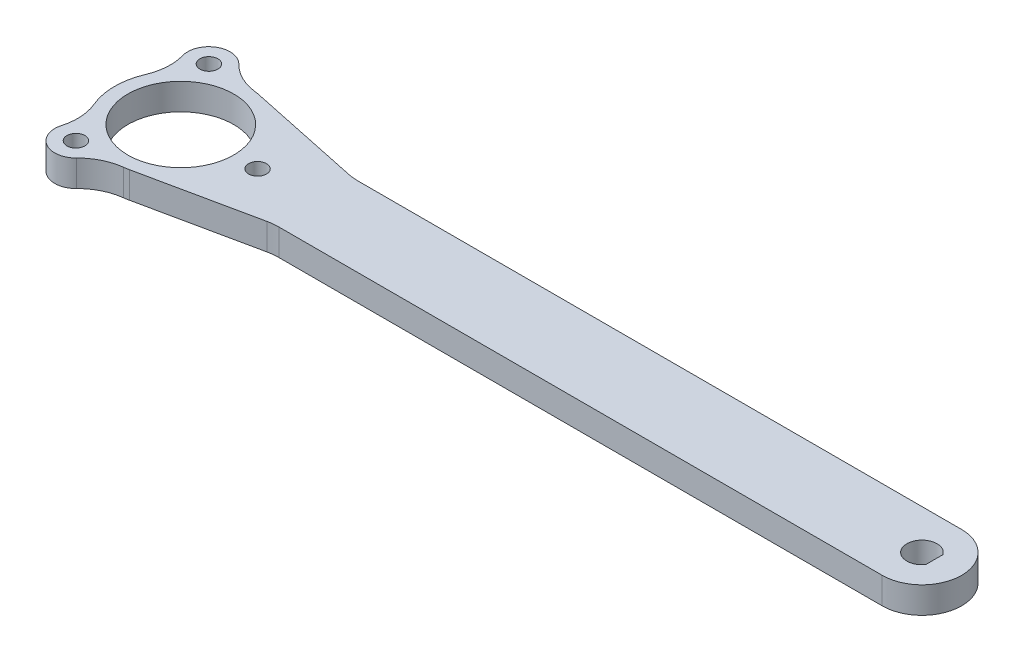
ISO-10303-21;
HEADER;
FILE_DESCRIPTION(('STEP AP214'),'2;1');
FILE_NAME('part.step','',(''),(''),'','','');
FILE_SCHEMA(('AUTOMOTIVE_DESIGN { 1 0 10303 214 1 1 1 1 }'));
ENDSEC;
DATA;
#1=APPLICATION_CONTEXT('core data for automotive mechanical design processes');
#2=APPLICATION_PROTOCOL_DEFINITION('international standard','automotive_design',2000,#1);
#3=PRODUCT_CONTEXT('',#1,'mechanical');
#4=PRODUCT('Part','Part','',(#3));
#5=PRODUCT_RELATED_PRODUCT_CATEGORY('part','',(#4));
#6=PRODUCT_DEFINITION_FORMATION('','',#4);
#7=PRODUCT_DEFINITION_CONTEXT('part definition',#1,'design');
#8=PRODUCT_DEFINITION('design','',#6,#7);
#9=PRODUCT_DEFINITION_SHAPE('','',#8);
#10=(LENGTH_UNIT() NAMED_UNIT(*) SI_UNIT(.MILLI.,.METRE.));
#11=(NAMED_UNIT(*) PLANE_ANGLE_UNIT() SI_UNIT($,.RADIAN.));
#12=(NAMED_UNIT(*) SI_UNIT($,.STERADIAN.) SOLID_ANGLE_UNIT());
#13=UNCERTAINTY_MEASURE_WITH_UNIT(LENGTH_MEASURE(1.E-05),#10,'distance_accuracy_value','');
#14=(GEOMETRIC_REPRESENTATION_CONTEXT(3) GLOBAL_UNCERTAINTY_ASSIGNED_CONTEXT((#13)) GLOBAL_UNIT_ASSIGNED_CONTEXT((#10,
#11,#12)) REPRESENTATION_CONTEXT('',''));
#15=CARTESIAN_POINT('',(0.,0.,0.));
#16=DIRECTION('',(0.,0.,1.));
#17=DIRECTION('',(1.,0.,0.));
#18=AXIS2_PLACEMENT_3D('',#15,#16,#17);
#19=CARTESIAN_POINT('',(0.,5.,0.));
#20=DIRECTION('',(0.,-1.,0.));
#21=DIRECTION('',(0.,0.,-1.));
#22=AXIS2_PLACEMENT_3D('',#19,#20,#21);
#23=CYLINDRICAL_SURFACE('',#22,12.5);
#24=CARTESIAN_POINT('',(0.,0.,0.));
#25=DIRECTION('',(0.,1.,0.));
#26=DIRECTION('',(0.,0.,1.));
#27=AXIS2_PLACEMENT_3D('',#24,#25,#26);
#28=CIRCLE('',#27,12.5);
#29=CARTESIAN_POINT('',(-11.5138720064284,0.,-4.86628723151269));
#30=VERTEX_POINT('',#29);
#31=CARTESIAN_POINT('',(-11.5138720064284,0.,4.86628723151285));
#32=VERTEX_POINT('',#31);
#33=EDGE_CURVE('E308',#30,#32,#28,.T.);
#34=ORIENTED_EDGE('',*,*,#33,.T.);
#35=DIRECTION('',(0.,-1.,0.));
#36=VECTOR('',#35,1.);
#37=CARTESIAN_POINT('',(-11.5138720064284,5.,4.86628723151285));
#38=LINE('',#37,#36);
#39=CARTESIAN_POINT('',(-11.5138720064284,5.,4.86628723151285));
#40=VERTEX_POINT('',#39);
#41=EDGE_CURVE('E219',#32,#40,#38,.F.);
#42=ORIENTED_EDGE('',*,*,#41,.T.);
#43=CARTESIAN_POINT('',(0.,5.,0.));
#44=DIRECTION('',(0.,1.,0.));
#45=DIRECTION('',(0.,0.,1.));
#46=AXIS2_PLACEMENT_3D('',#43,#44,#45);
#47=CIRCLE('',#46,12.5);
#48=CARTESIAN_POINT('',(-11.5138720064284,5.,-4.86628723151269));
#49=VERTEX_POINT('',#48);
#50=EDGE_CURVE('E368',#49,#40,#47,.T.);
#51=ORIENTED_EDGE('',*,*,#50,.F.);
#52=DIRECTION('',(0.,-1.,0.));
#53=VECTOR('',#52,1.);
#54=CARTESIAN_POINT('',(-11.5138720064284,5.,-4.86628723151269));
#55=LINE('',#54,#53);
#56=EDGE_CURVE('E216',#49,#30,#55,.T.);
#57=ORIENTED_EDGE('',*,*,#56,.T.);
#58=EDGE_LOOP('',(#34,#42,#51,#57));
#59=FACE_BOUND('',#58,.T.);
#60=ADVANCED_FACE('F41',(#59),#23,.T.);
#61=CARTESIAN_POINT('',(2.580796540168,0.,-12.23067819944));
#62=VERTEX_POINT('',#61);
#63=CARTESIAN_POINT('',(1.54260763861227,0.,-12.4044492692459));
#64=VERTEX_POINT('',#63);
#65=EDGE_CURVE('E293',#62,#64,#28,.T.);
#66=ORIENTED_EDGE('',*,*,#65,.T.);
#67=DIRECTION('',(0.,-1.,0.));
#68=VECTOR('',#67,1.);
#69=CARTESIAN_POINT('',(1.54260763861227,5.,-12.4044492692459));
#70=LINE('',#69,#68);
#71=CARTESIAN_POINT('',(1.54260763861227,5.,-12.4044492692459));
#72=VERTEX_POINT('',#71);
#73=EDGE_CURVE('E230',#64,#72,#70,.F.);
#74=ORIENTED_EDGE('',*,*,#73,.T.);
#75=CARTESIAN_POINT('',(2.580796540168,5.,-12.23067819944));
#76=VERTEX_POINT('',#75);
#77=EDGE_CURVE('E296',#76,#72,#47,.T.);
#78=ORIENTED_EDGE('',*,*,#77,.F.);
#79=DIRECTION('',(0.,-1.,0.));
#80=VECTOR('',#79,1.);
#81=CARTESIAN_POINT('',(2.580796540168,5.,-12.23067819944));
#82=LINE('',#81,#80);
#83=EDGE_CURVE('E202',#76,#62,#82,.T.);
#84=ORIENTED_EDGE('',*,*,#83,.T.);
#85=EDGE_LOOP('',(#66,#74,#78,#84));
#86=FACE_BOUND('',#85,.T.);
#87=ADVANCED_FACE('F292',(#86),#23,.T.);
#88=CARTESIAN_POINT('',(140.,5.,0.));
#89=DIRECTION('',(0.,-1.,0.));
#90=DIRECTION('',(0.,0.,-1.));
#91=AXIS2_PLACEMENT_3D('',#88,#89,#90);
#92=CYLINDRICAL_SURFACE('',#91,2.85);
#93=CARTESIAN_POINT('',(140.,0.,0.));
#94=DIRECTION('',(0.,1.,0.));
#95=DIRECTION('',(0.,0.,1.));
#96=AXIS2_PLACEMENT_3D('',#93,#94,#95);
#97=CIRCLE('',#96,2.85);
#98=CARTESIAN_POINT('',(142.348879749008,0.,-1.61408299808355));
#99=VERTEX_POINT('',#98);
#100=CARTESIAN_POINT('',(142.348879749008,0.,1.61408299808355));
#101=VERTEX_POINT('',#100);
#102=EDGE_CURVE('E329',#99,#101,#97,.T.);
#103=ORIENTED_EDGE('',*,*,#102,.F.);
#104=DIRECTION('',(0.,-1.,0.));
#105=VECTOR('',#104,1.);
#106=CARTESIAN_POINT('',(142.348879749008,5.,-1.61408299808355));
#107=LINE('',#106,#105);
#108=CARTESIAN_POINT('',(142.348879749008,5.,-1.61408299808355));
#109=VERTEX_POINT('',#108);
#110=EDGE_CURVE('E200',#109,#99,#107,.T.);
#111=ORIENTED_EDGE('',*,*,#110,.F.);
#112=CARTESIAN_POINT('',(140.,5.,0.));
#113=DIRECTION('',(0.,1.,0.));
#114=DIRECTION('',(0.,0.,1.));
#115=AXIS2_PLACEMENT_3D('',#112,#113,#114);
#116=CIRCLE('',#115,2.85);
#117=CARTESIAN_POINT('',(142.348879749008,5.,1.61408299808355));
#118=VERTEX_POINT('',#117);
#119=EDGE_CURVE('E342',#109,#118,#116,.T.);
#120=ORIENTED_EDGE('',*,*,#119,.T.);
#121=DIRECTION('',(0.,-1.,0.));
#122=VECTOR('',#121,1.);
#123=CARTESIAN_POINT('',(142.348879749008,5.,1.61408299808355));
#124=LINE('',#123,#122);
#125=EDGE_CURVE('E196',#118,#101,#124,.T.);
#126=ORIENTED_EDGE('',*,*,#125,.T.);
#127=EDGE_LOOP('',(#103,#111,#120,#126));
#128=FACE_BOUND('',#127,.T.);
#129=ADVANCED_FACE('F340',(#128),#92,.F.);
#130=CARTESIAN_POINT('',(0.,5.,7.5));
#131=DIRECTION('',(0.,0.,-1.));
#132=DIRECTION('',(-1.,0.,0.));
#133=AXIS2_PLACEMENT_3D('',#130,#131,#132);
#134=PLANE('',#133);
#135=DIRECTION('',(1.,0.,0.));
#136=VECTOR('',#135,1.);
#137=CARTESIAN_POINT('',(0.,5.,7.5));
#138=LINE('',#137,#136);
#139=CARTESIAN_POINT('',(26.0435607626104,5.,7.5));
#140=VERTEX_POINT('',#139);
#141=CARTESIAN_POINT('',(140.,5.,7.50000000000001));
#142=VERTEX_POINT('',#141);
#143=EDGE_CURVE('E165',#140,#142,#138,.T.);
#144=ORIENTED_EDGE('',*,*,#143,.F.);
#145=DIRECTION('',(0.,-1.,0.));
#146=VECTOR('',#145,1.);
#147=CARTESIAN_POINT('',(26.0435607626104,0.,7.5));
#148=LINE('',#147,#146);
#149=CARTESIAN_POINT('',(26.0435607626104,0.,7.5));
#150=VERTEX_POINT('',#149);
#151=EDGE_CURVE('E234',#140,#150,#148,.T.);
#152=ORIENTED_EDGE('',*,*,#151,.T.);
#153=DIRECTION('',(1.,0.,0.));
#154=VECTOR('',#153,1.);
#155=CARTESIAN_POINT('',(0.,0.,7.5));
#156=LINE('',#155,#154);
#157=CARTESIAN_POINT('',(140.,0.,7.50000000000001));
#158=VERTEX_POINT('',#157);
#159=EDGE_CURVE('E193',#150,#158,#156,.T.);
#160=ORIENTED_EDGE('',*,*,#159,.T.);
#161=DIRECTION('',(0.,-1.,0.));
#162=VECTOR('',#161,1.);
#163=CARTESIAN_POINT('',(140.,5.,7.50000000000001));
#164=LINE('',#163,#162);
#165=EDGE_CURVE('E185',#142,#158,#164,.T.);
#166=ORIENTED_EDGE('',*,*,#165,.F.);
#167=EDGE_LOOP('',(#144,#152,#160,#166));
#168=FACE_BOUND('',#167,.T.);
#169=ADVANCED_FACE('F191',(#168),#134,.F.);
#170=CARTESIAN_POINT('',(140.,5.,0.));
#171=DIRECTION('',(0.,-1.,0.));
#172=DIRECTION('',(0.,0.,-1.));
#173=AXIS2_PLACEMENT_3D('',#170,#171,#172);
#174=CYLINDRICAL_SURFACE('',#173,7.50000000000001);
#175=CARTESIAN_POINT('',(140.,0.,0.));
#176=DIRECTION('',(0.,1.,0.));
#177=DIRECTION('',(0.,0.,1.));
#178=AXIS2_PLACEMENT_3D('',#175,#176,#177);
#179=CIRCLE('',#178,7.50000000000001);
#180=CARTESIAN_POINT('',(140.,0.,-7.50000000000001));
#181=VERTEX_POINT('',#180);
#182=EDGE_CURVE('E318',#158,#181,#179,.T.);
#183=ORIENTED_EDGE('',*,*,#182,.T.);
#184=DIRECTION('',(0.,-1.,0.));
#185=VECTOR('',#184,1.);
#186=CARTESIAN_POINT('',(140.,5.,-7.50000000000001));
#187=LINE('',#186,#185);
#188=CARTESIAN_POINT('',(140.,5.,-7.50000000000001));
#189=VERTEX_POINT('',#188);
#190=EDGE_CURVE('E187',#189,#181,#187,.T.);
#191=ORIENTED_EDGE('',*,*,#190,.F.);
#192=CARTESIAN_POINT('',(140.,5.,0.));
#193=DIRECTION('',(0.,1.,0.));
#194=DIRECTION('',(0.,0.,1.));
#195=AXIS2_PLACEMENT_3D('',#192,#193,#194);
#196=CIRCLE('',#195,7.50000000000001);
#197=EDGE_CURVE('E170',#142,#189,#196,.T.);
#198=ORIENTED_EDGE('',*,*,#197,.F.);
#199=ORIENTED_EDGE('',*,*,#165,.T.);
#200=EDGE_LOOP('',(#183,#191,#198,#199));
#201=FACE_BOUND('',#200,.T.);
#202=ADVANCED_FACE('F184',(#201),#174,.T.);
#203=CARTESIAN_POINT('',(0.,5.,-7.5));
#204=DIRECTION('',(0.,0.,-1.));
#205=DIRECTION('',(-1.,0.,0.));
#206=AXIS2_PLACEMENT_3D('',#203,#204,#205);
#207=PLANE('',#206);
#208=DIRECTION('',(1.,0.,0.));
#209=VECTOR('',#208,1.);
#210=CARTESIAN_POINT('',(0.,0.,-7.5));
#211=LINE('',#210,#209);
#212=CARTESIAN_POINT('',(26.0435607626104,0.,-7.5));
#213=VERTEX_POINT('',#212);
#214=EDGE_CURVE('E314',#213,#181,#211,.T.);
#215=ORIENTED_EDGE('',*,*,#214,.F.);
#216=DIRECTION('',(0.,-1.,0.));
#217=VECTOR('',#216,1.);
#218=CARTESIAN_POINT('',(26.0435607626104,5.,-7.5));
#219=LINE('',#218,#217);
#220=CARTESIAN_POINT('',(26.0435607626104,5.,-7.5));
#221=VERTEX_POINT('',#220);
#222=EDGE_CURVE('E57',#213,#221,#219,.F.);
#223=ORIENTED_EDGE('',*,*,#222,.T.);
#224=DIRECTION('',(1.,0.,0.));
#225=VECTOR('',#224,1.);
#226=CARTESIAN_POINT('',(0.,5.,-7.5));
#227=LINE('',#226,#225);
#228=EDGE_CURVE('E189',#221,#189,#227,.T.);
#229=ORIENTED_EDGE('',*,*,#228,.T.);
#230=ORIENTED_EDGE('',*,*,#190,.T.);
#231=EDGE_LOOP('',(#215,#223,#229,#230));
#232=FACE_BOUND('',#231,.T.);
#233=ADVANCED_FACE('F358',(#232),#207,.T.);
#234=CARTESIAN_POINT('',(2.580796540168,5.,-12.23067819944));
#235=DIRECTION('',(0.20646372321344,0.,-0.9784542559552));
#236=DIRECTION('',(-0.9784542559552,0.,-0.20646372321344));
#237=AXIS2_PLACEMENT_3D('',#234,#235,#236);
#238=PLANE('',#237);
#239=DIRECTION('',(0.9784542559552,0.,0.20646372321344));
#240=VECTOR('',#239,1.);
#241=CARTESIAN_POINT('',(2.580796540168,5.,-12.23067819944));
#242=LINE('',#241,#240);
#243=CARTESIAN_POINT('',(23.978923530476,5.,-7.715457440448));
#244=VERTEX_POINT('',#243);
#245=EDGE_CURVE('E361',#76,#244,#242,.T.);
#246=ORIENTED_EDGE('',*,*,#245,.T.);
#247=DIRECTION('',(0.,-1.,0.));
#248=VECTOR('',#247,1.);
#249=CARTESIAN_POINT('',(23.978923530476,0.,-7.715457440448));
#250=LINE('',#249,#248);
#251=CARTESIAN_POINT('',(23.978923530476,0.,-7.715457440448));
#252=VERTEX_POINT('',#251);
#253=EDGE_CURVE('E240',#244,#252,#250,.T.);
#254=ORIENTED_EDGE('',*,*,#253,.T.);
#255=DIRECTION('',(0.9784542559552,0.,0.20646372321344));
#256=VECTOR('',#255,1.);
#257=CARTESIAN_POINT('',(2.580796540168,0.,-12.23067819944));
#258=LINE('',#257,#256);
#259=EDGE_CURVE('E303',#62,#252,#258,.T.);
#260=ORIENTED_EDGE('',*,*,#259,.F.);
#261=ORIENTED_EDGE('',*,*,#83,.F.);
#262=EDGE_LOOP('',(#246,#254,#260,#261));
#263=FACE_BOUND('',#262,.T.);
#264=ADVANCED_FACE('F311',(#263),#238,.T.);
#265=CARTESIAN_POINT('',(1.54260763861245,5.,12.4044492692459));
#266=VERTEX_POINT('',#265);
#267=CARTESIAN_POINT('',(2.580796540168,5.,12.23067819944));
#268=VERTEX_POINT('',#267);
#269=EDGE_CURVE('E364',#266,#268,#47,.T.);
#270=ORIENTED_EDGE('',*,*,#269,.F.);
#271=DIRECTION('',(0.,-1.,0.));
#272=VECTOR('',#271,1.);
#273=CARTESIAN_POINT('',(1.54260763861245,5.,12.4044492692459));
#274=LINE('',#273,#272);
#275=CARTESIAN_POINT('',(1.54260763861245,0.,12.4044492692459));
#276=VERTEX_POINT('',#275);
#277=EDGE_CURVE('E213',#266,#276,#274,.T.);
#278=ORIENTED_EDGE('',*,*,#277,.T.);
#279=CARTESIAN_POINT('',(2.580796540168,0.,12.23067819944));
#280=VERTEX_POINT('',#279);
#281=EDGE_CURVE('E310',#276,#280,#28,.T.);
#282=ORIENTED_EDGE('',*,*,#281,.T.);
#283=DIRECTION('',(0.,-1.,0.));
#284=VECTOR('',#283,1.);
#285=CARTESIAN_POINT('',(2.580796540168,5.,12.23067819944));
#286=LINE('',#285,#284);
#287=EDGE_CURVE('E283',#268,#280,#286,.T.);
#288=ORIENTED_EDGE('',*,*,#287,.F.);
#289=EDGE_LOOP('',(#270,#278,#282,#288));
#290=FACE_BOUND('',#289,.T.);
#291=ADVANCED_FACE('F381',(#290),#23,.T.);
#292=CARTESIAN_POINT('',(0.,5.,0.));
#293=DIRECTION('',(0.,-1.,0.));
#294=DIRECTION('',(0.,0.,-1.));
#295=AXIS2_PLACEMENT_3D('',#292,#293,#294);
#296=CYLINDRICAL_SURFACE('',#295,10.);
#297=CARTESIAN_POINT('',(0.,5.,0.));
#298=DIRECTION('',(0.,1.,0.));
#299=DIRECTION('',(0.,0.,1.));
#300=AXIS2_PLACEMENT_3D('',#297,#298,#299);
#301=CIRCLE('',#300,10.);
#302=CARTESIAN_POINT('',(0.,5.,10.));
#303=VERTEX_POINT('',#302);
#304=EDGE_CURVE('E345',#303,#303,#301,.T.);
#305=ORIENTED_EDGE('',*,*,#304,.T.);
#306=EDGE_LOOP('',(#305));
#307=FACE_BOUND('',#306,.T.);
#308=CARTESIAN_POINT('',(0.,0.,0.));
#309=DIRECTION('',(0.,1.,0.));
#310=DIRECTION('',(0.,0.,1.));
#311=AXIS2_PLACEMENT_3D('',#308,#309,#310);
#312=CIRCLE('',#311,10.);
#313=CARTESIAN_POINT('',(0.,0.,10.));
#314=VERTEX_POINT('',#313);
#315=EDGE_CURVE('E325',#314,#314,#312,.T.);
#316=ORIENTED_EDGE('',*,*,#315,.F.);
#317=EDGE_LOOP('',(#316));
#318=FACE_BOUND('',#317,.T.);
#319=ADVANCED_FACE('F445',(#307,#318),#296,.F.);
#320=CARTESIAN_POINT('',(2.580796540168,5.,12.23067819944));
#321=DIRECTION('',(-0.20646372321344,0.,-0.9784542559552));
#322=DIRECTION('',(-0.9784542559552,0.,0.20646372321344));
#323=AXIS2_PLACEMENT_3D('',#320,#321,#322);
#324=PLANE('',#323);
#325=DIRECTION('',(0.9784542559552,0.,-0.20646372321344));
#326=VECTOR('',#325,1.);
#327=CARTESIAN_POINT('',(2.580796540168,0.,12.23067819944));
#328=LINE('',#327,#326);
#329=CARTESIAN_POINT('',(23.978923530476,0.,7.715457440448));
#330=VERTEX_POINT('',#329);
#331=EDGE_CURVE('E307',#280,#330,#328,.T.);
#332=ORIENTED_EDGE('',*,*,#331,.T.);
#333=DIRECTION('',(0.,-1.,0.));
#334=VECTOR('',#333,1.);
#335=CARTESIAN_POINT('',(23.978923530476,5.,7.715457440448));
#336=LINE('',#335,#334);
#337=CARTESIAN_POINT('',(23.978923530476,5.,7.715457440448));
#338=VERTEX_POINT('',#337);
#339=EDGE_CURVE('E237',#330,#338,#336,.F.);
#340=ORIENTED_EDGE('',*,*,#339,.T.);
#341=DIRECTION('',(0.9784542559552,0.,-0.20646372321344));
#342=VECTOR('',#341,1.);
#343=CARTESIAN_POINT('',(2.580796540168,5.,12.23067819944));
#344=LINE('',#343,#342);
#345=EDGE_CURVE('E351',#268,#338,#344,.T.);
#346=ORIENTED_EDGE('',*,*,#345,.F.);
#347=ORIENTED_EDGE('',*,*,#287,.T.);
#348=EDGE_LOOP('',(#332,#340,#346,#347));
#349=FACE_BOUND('',#348,.T.);
#350=ADVANCED_FACE('F379',(#349),#324,.F.);
#351=CARTESIAN_POINT('',(142.348879749008,5.,0.));
#352=DIRECTION('',(1.,0.,0.));
#353=DIRECTION('',(0.,0.,-1.));
#354=AXIS2_PLACEMENT_3D('',#351,#352,#353);
#355=PLANE('',#354);
#356=DIRECTION('',(0.,0.,1.));
#357=VECTOR('',#356,1.);
#358=CARTESIAN_POINT('',(142.348879749008,0.,0.));
#359=LINE('',#358,#357);
#360=EDGE_CURVE('E179',#99,#101,#359,.T.);
#361=ORIENTED_EDGE('',*,*,#360,.T.);
#362=ORIENTED_EDGE('',*,*,#125,.F.);
#363=DIRECTION('',(0.,0.,1.));
#364=VECTOR('',#363,1.);
#365=CARTESIAN_POINT('',(142.348879749008,5.,0.));
#366=LINE('',#365,#364);
#367=EDGE_CURVE('E286',#109,#118,#366,.T.);
#368=ORIENTED_EDGE('',*,*,#367,.F.);
#369=ORIENTED_EDGE('',*,*,#110,.T.);
#370=EDGE_LOOP('',(#361,#362,#368,#369));
#371=FACE_BOUND('',#370,.T.);
#372=ADVANCED_FACE('F334',(#371),#355,.F.);
#373=CARTESIAN_POINT('',(0.,5.,0.));
#374=DIRECTION('',(0.,1.,0.));
#375=DIRECTION('',(0.,0.,1.));
#376=AXIS2_PLACEMENT_3D('',#373,#374,#375);
#377=PLANE('',#376);
#378=CARTESIAN_POINT('',(14.5,5.,-2.02962646689286E-13));
#379=DIRECTION('',(0.,1.,0.));
#380=DIRECTION('',(0.,0.,1.));
#381=AXIS2_PLACEMENT_3D('',#378,#379,#380);
#382=CIRCLE('',#381,1.7);
#383=CARTESIAN_POINT('',(14.5,5.,1.6999999999998));
#384=VERTEX_POINT('',#383);
#385=EDGE_CURVE('E679',#384,#384,#382,.T.);
#386=ORIENTED_EDGE('',*,*,#385,.F.);
#387=EDGE_LOOP('',(#386));
#388=FACE_BOUND('',#387,.T.);
#389=CARTESIAN_POINT('',(-7.24999999999988,5.,12.5573683548744));
#390=DIRECTION('',(0.,1.,0.));
#391=DIRECTION('',(0.,0.,1.));
#392=AXIS2_PLACEMENT_3D('',#389,#390,#391);
#393=CIRCLE('',#392,1.7);
#394=CARTESIAN_POINT('',(-7.24999999999988,5.,14.2573683548744));
#395=VERTEX_POINT('',#394);
#396=EDGE_CURVE('E405',#395,#395,#393,.T.);
#397=ORIENTED_EDGE('',*,*,#396,.F.);
#398=EDGE_LOOP('',(#397));
#399=FACE_BOUND('',#398,.T.);
#400=CARTESIAN_POINT('',(-7.25000000000006,5.,-12.5573683548743));
#401=DIRECTION('',(0.,1.,0.));
#402=DIRECTION('',(0.,0.,1.));
#403=AXIS2_PLACEMENT_3D('',#400,#401,#402);
#404=CIRCLE('',#403,1.7);
#405=CARTESIAN_POINT('',(-7.25000000000006,5.,-10.8573683548743));
#406=VERTEX_POINT('',#405);
#407=EDGE_CURVE('E402',#406,#406,#404,.T.);
#408=ORIENTED_EDGE('',*,*,#407,.F.);
#409=EDGE_LOOP('',(#408));
#410=FACE_BOUND('',#409,.T.);
#411=ORIENTED_EDGE('',*,*,#345,.T.);
#412=CARTESIAN_POINT('',(26.0435607626104,5.,17.5));
#413=DIRECTION('',(0.,1.,0.));
#414=DIRECTION('',(0.,0.,1.));
#415=AXIS2_PLACEMENT_3D('',#412,#413,#414);
#416=CIRCLE('',#415,10.);
#417=EDGE_CURVE('E173',#338,#140,#416,.F.);
#418=ORIENTED_EDGE('',*,*,#417,.T.);
#419=ORIENTED_EDGE('',*,*,#143,.T.);
#420=ORIENTED_EDGE('',*,*,#197,.T.);
#421=ORIENTED_EDGE('',*,*,#228,.F.);
#422=CARTESIAN_POINT('',(26.0435607626104,5.,-17.5));
#423=DIRECTION('',(0.,1.,0.));
#424=DIRECTION('',(0.,0.,1.));
#425=AXIS2_PLACEMENT_3D('',#422,#423,#424);
#426=CIRCLE('',#425,10.);
#427=EDGE_CURVE('E11',#221,#244,#426,.F.);
#428=ORIENTED_EDGE('',*,*,#427,.T.);
#429=ORIENTED_EDGE('',*,*,#245,.F.);
#430=ORIENTED_EDGE('',*,*,#77,.T.);
#431=CARTESIAN_POINT('',(2.77669374950209,5.,-22.3280086846426));
#432=DIRECTION('',(0.,1.,0.));
#433=DIRECTION('',(0.,0.,1.));
#434=AXIS2_PLACEMENT_3D('',#431,#432,#433);
#435=CIRCLE('',#434,10.);
#436=CARTESIAN_POINT('',(-4.38523035728516,5.,-15.3489798776653));
#437=VERTEX_POINT('',#436);
#438=EDGE_CURVE('E264',#72,#437,#435,.F.);
#439=ORIENTED_EDGE('',*,*,#438,.T.);
#440=CARTESIAN_POINT('',(-7.25000000000006,5.,-12.5573683548743));
#441=DIRECTION('',(0.,1.,0.));
#442=DIRECTION('',(0.,0.,1.));
#443=AXIS2_PLACEMENT_3D('',#440,#441,#442);
#444=CIRCLE('',#443,4.);
#445=CARTESIAN_POINT('',(-11.0999913175918,5.,-11.4722108296882));
#446=VERTEX_POINT('',#445);
#447=EDGE_CURVE('E416',#437,#446,#444,.T.);
#448=ORIENTED_EDGE('',*,*,#447,.T.);
#449=CARTESIAN_POINT('',(-20.7249696115712,5.,-8.75931701672284));
#450=DIRECTION('',(0.,1.,0.));
#451=DIRECTION('',(0.,0.,1.));
#452=AXIS2_PLACEMENT_3D('',#449,#450,#451);
#453=CIRCLE('',#452,10.);
#454=EDGE_CURVE('E258',#446,#49,#453,.F.);
#455=ORIENTED_EDGE('',*,*,#454,.T.);
#456=ORIENTED_EDGE('',*,*,#50,.T.);
#457=CARTESIAN_POINT('',(-20.7249696115711,5.,8.75931701672313));
#458=DIRECTION('',(0.,1.,0.));
#459=DIRECTION('',(0.,0.,1.));
#460=AXIS2_PLACEMENT_3D('',#457,#458,#459);
#461=CIRCLE('',#460,10.);
#462=CARTESIAN_POINT('',(-11.0999913175917,5.,11.4722108296883));
#463=VERTEX_POINT('',#462);
#464=EDGE_CURVE('E252',#40,#463,#461,.F.);
#465=ORIENTED_EDGE('',*,*,#464,.T.);
#466=CARTESIAN_POINT('',(-7.24999999999988,5.,12.5573683548744));
#467=DIRECTION('',(0.,1.,0.));
#468=DIRECTION('',(0.866025403784436,0.,-0.500000000000004));
#469=AXIS2_PLACEMENT_3D('',#466,#467,#468);
#470=CIRCLE('',#469,4.);
#471=CARTESIAN_POINT('',(-4.38523035728494,5.,15.3489798776653));
#472=VERTEX_POINT('',#471);
#473=EDGE_CURVE('E393',#463,#472,#470,.T.);
#474=ORIENTED_EDGE('',*,*,#473,.T.);
#475=CARTESIAN_POINT('',(2.7766937495024,5.,22.3280086846426));
#476=DIRECTION('',(0.,1.,0.));
#477=DIRECTION('',(0.,0.,1.));
#478=AXIS2_PLACEMENT_3D('',#475,#476,#477);
#479=CIRCLE('',#478,10.);
#480=EDGE_CURVE('E246',#472,#266,#479,.F.);
#481=ORIENTED_EDGE('',*,*,#480,.T.);
#482=ORIENTED_EDGE('',*,*,#269,.T.);
#483=EDGE_LOOP('',(#411,#418,#419,#420,#421,#428,#429,#430,#439,#448,#455,#456,#465,#474,#481,#482));
#484=FACE_BOUND('',#483,.T.);
#485=ORIENTED_EDGE('',*,*,#304,.F.);
#486=EDGE_LOOP('',(#485));
#487=FACE_BOUND('',#486,.T.);
#488=ORIENTED_EDGE('',*,*,#119,.F.);
#489=ORIENTED_EDGE('',*,*,#367,.T.);
#490=EDGE_LOOP('',(#488,#489));
#491=FACE_BOUND('',#490,.T.);
#492=ADVANCED_FACE('F168',(#388,#399,#410,#484,#487,#491),#377,.T.);
#493=CARTESIAN_POINT('',(0.,0.,0.));
#494=DIRECTION('',(0.,1.,0.));
#495=DIRECTION('',(0.,0.,1.));
#496=AXIS2_PLACEMENT_3D('',#493,#494,#495);
#497=PLANE('',#496);
#498=CARTESIAN_POINT('',(14.5,0.,-2.02962646689286E-13));
#499=DIRECTION('',(0.,1.,0.));
#500=DIRECTION('',(0.,0.,1.));
#501=AXIS2_PLACEMENT_3D('',#498,#499,#500);
#502=CIRCLE('',#501,1.7);
#503=CARTESIAN_POINT('',(14.5,0.,1.6999999999998));
#504=VERTEX_POINT('',#503);
#505=EDGE_CURVE('E684',#504,#504,#502,.T.);
#506=ORIENTED_EDGE('',*,*,#505,.T.);
#507=EDGE_LOOP('',(#506));
#508=FACE_BOUND('',#507,.T.);
#509=CARTESIAN_POINT('',(-7.24999999999988,0.,12.5573683548744));
#510=DIRECTION('',(0.,1.,0.));
#511=DIRECTION('',(0.,0.,1.));
#512=AXIS2_PLACEMENT_3D('',#509,#510,#511);
#513=CIRCLE('',#512,1.7);
#514=CARTESIAN_POINT('',(-7.24999999999988,0.,14.2573683548744));
#515=VERTEX_POINT('',#514);
#516=EDGE_CURVE('E398',#515,#515,#513,.T.);
#517=ORIENTED_EDGE('',*,*,#516,.T.);
#518=EDGE_LOOP('',(#517));
#519=FACE_BOUND('',#518,.T.);
#520=ORIENTED_EDGE('',*,*,#102,.T.);
#521=ORIENTED_EDGE('',*,*,#360,.F.);
#522=EDGE_LOOP('',(#520,#521));
#523=FACE_BOUND('',#522,.T.);
#524=ORIENTED_EDGE('',*,*,#315,.T.);
#525=EDGE_LOOP('',(#524));
#526=FACE_BOUND('',#525,.T.);
#527=ORIENTED_EDGE('',*,*,#159,.F.);
#528=CARTESIAN_POINT('',(26.0435607626104,0.,17.5));
#529=DIRECTION('',(0.,1.,0.));
#530=DIRECTION('',(0.,0.,1.));
#531=AXIS2_PLACEMENT_3D('',#528,#529,#530);
#532=CIRCLE('',#531,10.);
#533=EDGE_CURVE('E270',#150,#330,#532,.T.);
#534=ORIENTED_EDGE('',*,*,#533,.T.);
#535=ORIENTED_EDGE('',*,*,#331,.F.);
#536=ORIENTED_EDGE('',*,*,#281,.F.);
#537=CARTESIAN_POINT('',(2.7766937495024,0.,22.3280086846426));
#538=DIRECTION('',(0.,1.,0.));
#539=DIRECTION('',(0.,0.,1.));
#540=AXIS2_PLACEMENT_3D('',#537,#538,#539);
#541=CIRCLE('',#540,10.);
#542=CARTESIAN_POINT('',(-4.38523035728494,0.,15.3489798776653));
#543=VERTEX_POINT('',#542);
#544=EDGE_CURVE('E249',#276,#543,#541,.T.);
#545=ORIENTED_EDGE('',*,*,#544,.T.);
#546=CARTESIAN_POINT('',(-7.24999999999988,0.,12.5573683548744));
#547=DIRECTION('',(0.,1.,0.));
#548=DIRECTION('',(0.,0.,1.));
#549=AXIS2_PLACEMENT_3D('',#546,#547,#548);
#550=CIRCLE('',#549,4.);
#551=CARTESIAN_POINT('',(-11.0999913175917,0.,11.4722108296883));
#552=VERTEX_POINT('',#551);
#553=EDGE_CURVE('E395',#543,#552,#550,.F.);
#554=ORIENTED_EDGE('',*,*,#553,.T.);
#555=CARTESIAN_POINT('',(-20.7249696115711,0.,8.75931701672313));
#556=DIRECTION('',(0.,1.,0.));
#557=DIRECTION('',(0.,0.,1.));
#558=AXIS2_PLACEMENT_3D('',#555,#556,#557);
#559=CIRCLE('',#558,10.);
#560=EDGE_CURVE('E255',#552,#32,#559,.T.);
#561=ORIENTED_EDGE('',*,*,#560,.T.);
#562=ORIENTED_EDGE('',*,*,#33,.F.);
#563=CARTESIAN_POINT('',(-20.7249696115712,0.,-8.75931701672284));
#564=DIRECTION('',(0.,1.,0.));
#565=DIRECTION('',(0.,0.,1.));
#566=AXIS2_PLACEMENT_3D('',#563,#564,#565);
#567=CIRCLE('',#566,10.);
#568=CARTESIAN_POINT('',(-11.0999913175918,0.,-11.4722108296882));
#569=VERTEX_POINT('',#568);
#570=EDGE_CURVE('E261',#30,#569,#567,.T.);
#571=ORIENTED_EDGE('',*,*,#570,.T.);
#572=CARTESIAN_POINT('',(-7.25000000000006,0.,-12.5573683548743));
#573=DIRECTION('',(0.,1.,0.));
#574=DIRECTION('',(0.,0.,1.));
#575=AXIS2_PLACEMENT_3D('',#572,#573,#574);
#576=CIRCLE('',#575,4.);
#577=CARTESIAN_POINT('',(-4.38523035728516,0.,-15.3489798776653));
#578=VERTEX_POINT('',#577);
#579=EDGE_CURVE('E356',#569,#578,#576,.F.);
#580=ORIENTED_EDGE('',*,*,#579,.T.);
#581=CARTESIAN_POINT('',(2.77669374950209,0.,-22.3280086846426));
#582=DIRECTION('',(0.,1.,0.));
#583=DIRECTION('',(0.,0.,1.));
#584=AXIS2_PLACEMENT_3D('',#581,#582,#583);
#585=CIRCLE('',#584,10.);
#586=EDGE_CURVE('E267',#578,#64,#585,.T.);
#587=ORIENTED_EDGE('',*,*,#586,.T.);
#588=ORIENTED_EDGE('',*,*,#65,.F.);
#589=ORIENTED_EDGE('',*,*,#259,.T.);
#590=CARTESIAN_POINT('',(26.0435607626104,0.,-17.5));
#591=DIRECTION('',(0.,1.,0.));
#592=DIRECTION('',(0.,0.,1.));
#593=AXIS2_PLACEMENT_3D('',#590,#591,#592);
#594=CIRCLE('',#593,10.);
#595=EDGE_CURVE('E50',#252,#213,#594,.T.);
#596=ORIENTED_EDGE('',*,*,#595,.T.);
#597=ORIENTED_EDGE('',*,*,#214,.T.);
#598=ORIENTED_EDGE('',*,*,#182,.F.);
#599=EDGE_LOOP('',(#527,#534,#535,#536,#545,#554,#561,#562,#571,#580,#587,#588,#589,#596,#597,#598));
#600=FACE_BOUND('',#599,.T.);
#601=CARTESIAN_POINT('',(-7.25000000000006,0.,-12.5573683548743));
#602=DIRECTION('',(0.,1.,0.));
#603=DIRECTION('',(0.,0.,1.));
#604=AXIS2_PLACEMENT_3D('',#601,#602,#603);
#605=CIRCLE('',#604,1.7);
#606=CARTESIAN_POINT('',(-7.25000000000006,0.,-10.8573683548743));
#607=VERTEX_POINT('',#606);
#608=EDGE_CURVE('E412',#607,#607,#605,.T.);
#609=ORIENTED_EDGE('',*,*,#608,.T.);
#610=EDGE_LOOP('',(#609));
#611=FACE_BOUND('',#610,.T.);
#612=ADVANCED_FACE('F301',(#508,#519,#523,#526,#600,#611),#497,.F.);
#613=CARTESIAN_POINT('',(-7.25000000000006,-12.0922883817816,-12.5573683548743));
#614=DIRECTION('',(0.,1.,0.));
#615=DIRECTION('',(0.,0.,1.));
#616=AXIS2_PLACEMENT_3D('',#613,#614,#615);
#617=CYLINDRICAL_SURFACE('',#616,4.);
#618=ORIENTED_EDGE('',*,*,#579,.F.);
#619=DIRECTION('',(0.,1.,0.));
#620=VECTOR('',#619,1.);
#621=CARTESIAN_POINT('',(-11.0999913175918,-12.0922883817816,-11.4722108296882));
#622=LINE('',#621,#620);
#623=EDGE_CURVE('E226',#569,#446,#622,.T.);
#624=ORIENTED_EDGE('',*,*,#623,.T.);
#625=ORIENTED_EDGE('',*,*,#447,.F.);
#626=DIRECTION('',(0.,1.,0.));
#627=VECTOR('',#626,1.);
#628=CARTESIAN_POINT('',(-4.38523035728516,-12.0922883817816,-15.3489798776653));
#629=LINE('',#628,#627);
#630=EDGE_CURVE('E223',#437,#578,#629,.F.);
#631=ORIENTED_EDGE('',*,*,#630,.T.);
#632=EDGE_LOOP('',(#618,#624,#625,#631));
#633=FACE_BOUND('',#632,.T.);
#634=ADVANCED_FACE('F539',(#633),#617,.T.);
#635=CARTESIAN_POINT('',(-7.25000000000006,5.,-12.5573683548743));
#636=DIRECTION('',(0.,1.,0.));
#637=DIRECTION('',(0.,0.,1.));
#638=AXIS2_PLACEMENT_3D('',#635,#636,#637);
#639=CYLINDRICAL_SURFACE('',#638,1.7);
#640=ORIENTED_EDGE('',*,*,#608,.F.);
#641=EDGE_LOOP('',(#640));
#642=FACE_BOUND('',#641,.T.);
#643=ORIENTED_EDGE('',*,*,#407,.T.);
#644=EDGE_LOOP('',(#643));
#645=FACE_BOUND('',#644,.T.);
#646=ADVANCED_FACE('F529',(#642,#645),#639,.F.);
#647=CARTESIAN_POINT('',(-7.24999999999988,-12.0922883817816,12.5573683548744));
#648=DIRECTION('',(0.,1.,0.));
#649=DIRECTION('',(0.,0.,1.));
#650=AXIS2_PLACEMENT_3D('',#647,#648,#649);
#651=CYLINDRICAL_SURFACE('',#650,4.);
#652=ORIENTED_EDGE('',*,*,#553,.F.);
#653=DIRECTION('',(0.,1.,0.));
#654=VECTOR('',#653,1.);
#655=CARTESIAN_POINT('',(-4.38523035728494,-12.0922883817816,15.3489798776653));
#656=LINE('',#655,#654);
#657=EDGE_CURVE('E209',#543,#472,#656,.T.);
#658=ORIENTED_EDGE('',*,*,#657,.T.);
#659=ORIENTED_EDGE('',*,*,#473,.F.);
#660=DIRECTION('',(0.,1.,0.));
#661=VECTOR('',#660,1.);
#662=CARTESIAN_POINT('',(-11.0999913175917,-12.0922883817816,11.4722108296883));
#663=LINE('',#662,#661);
#664=EDGE_CURVE('E206',#463,#552,#663,.F.);
#665=ORIENTED_EDGE('',*,*,#664,.T.);
#666=EDGE_LOOP('',(#652,#658,#659,#665));
#667=FACE_BOUND('',#666,.T.);
#668=ADVANCED_FACE('F392',(#667),#651,.T.);
#669=CARTESIAN_POINT('',(-7.24999999999988,5.,12.5573683548744));
#670=DIRECTION('',(0.,1.,0.));
#671=DIRECTION('',(0.,0.,1.));
#672=AXIS2_PLACEMENT_3D('',#669,#670,#671);
#673=CYLINDRICAL_SURFACE('',#672,1.7);
#674=ORIENTED_EDGE('',*,*,#516,.F.);
#675=EDGE_LOOP('',(#674));
#676=FACE_BOUND('',#675,.T.);
#677=ORIENTED_EDGE('',*,*,#396,.T.);
#678=EDGE_LOOP('',(#677));
#679=FACE_BOUND('',#678,.T.);
#680=ADVANCED_FACE('F512',(#676,#679),#673,.F.);
#681=CARTESIAN_POINT('',(14.5,5.,-2.02962646689286E-13));
#682=DIRECTION('',(0.,1.,0.));
#683=DIRECTION('',(0.,0.,1.));
#684=AXIS2_PLACEMENT_3D('',#681,#682,#683);
#685=CYLINDRICAL_SURFACE('',#684,1.7);
#686=ORIENTED_EDGE('',*,*,#505,.F.);
#687=EDGE_LOOP('',(#686));
#688=FACE_BOUND('',#687,.T.);
#689=ORIENTED_EDGE('',*,*,#385,.T.);
#690=EDGE_LOOP('',(#689));
#691=FACE_BOUND('',#690,.T.);
#692=ADVANCED_FACE('F464',(#688,#691),#685,.F.);
#693=CARTESIAN_POINT('',(2.7766937495024,5.,22.3280086846426));
#694=DIRECTION('',(0.,-1.,0.));
#695=DIRECTION('',(0.,0.,-1.));
#696=AXIS2_PLACEMENT_3D('',#693,#694,#695);
#697=CYLINDRICAL_SURFACE('',#696,10.);
#698=ORIENTED_EDGE('',*,*,#544,.F.);
#699=ORIENTED_EDGE('',*,*,#277,.F.);
#700=ORIENTED_EDGE('',*,*,#480,.F.);
#701=ORIENTED_EDGE('',*,*,#657,.F.);
#702=EDGE_LOOP('',(#698,#699,#700,#701));
#703=FACE_BOUND('',#702,.T.);
#704=ADVANCED_FACE('F388',(#703),#697,.F.);
#705=CARTESIAN_POINT('',(-20.7249696115711,-12.0922883817816,8.75931701672313));
#706=DIRECTION('',(0.,-1.,0.));
#707=DIRECTION('',(0.,0.,-1.));
#708=AXIS2_PLACEMENT_3D('',#705,#706,#707);
#709=CYLINDRICAL_SURFACE('',#708,10.);
#710=ORIENTED_EDGE('',*,*,#560,.F.);
#711=ORIENTED_EDGE('',*,*,#664,.F.);
#712=ORIENTED_EDGE('',*,*,#464,.F.);
#713=ORIENTED_EDGE('',*,*,#41,.F.);
#714=EDGE_LOOP('',(#710,#711,#712,#713));
#715=FACE_BOUND('',#714,.T.);
#716=ADVANCED_FACE('F463',(#715),#709,.F.);
#717=CARTESIAN_POINT('',(-20.7249696115712,5.,-8.75931701672284));
#718=DIRECTION('',(0.,-1.,0.));
#719=DIRECTION('',(0.,0.,-1.));
#720=AXIS2_PLACEMENT_3D('',#717,#718,#719);
#721=CYLINDRICAL_SURFACE('',#720,10.);
#722=ORIENTED_EDGE('',*,*,#570,.F.);
#723=ORIENTED_EDGE('',*,*,#56,.F.);
#724=ORIENTED_EDGE('',*,*,#454,.F.);
#725=ORIENTED_EDGE('',*,*,#623,.F.);
#726=EDGE_LOOP('',(#722,#723,#724,#725));
#727=FACE_BOUND('',#726,.T.);
#728=ADVANCED_FACE('F467',(#727),#721,.F.);
#729=CARTESIAN_POINT('',(2.77669374950209,-12.0922883817816,-22.3280086846426));
#730=DIRECTION('',(0.,-1.,0.));
#731=DIRECTION('',(0.,0.,-1.));
#732=AXIS2_PLACEMENT_3D('',#729,#730,#731);
#733=CYLINDRICAL_SURFACE('',#732,10.);
#734=ORIENTED_EDGE('',*,*,#586,.F.);
#735=ORIENTED_EDGE('',*,*,#630,.F.);
#736=ORIENTED_EDGE('',*,*,#438,.F.);
#737=ORIENTED_EDGE('',*,*,#73,.F.);
#738=EDGE_LOOP('',(#734,#735,#736,#737));
#739=FACE_BOUND('',#738,.T.);
#740=ADVANCED_FACE('F428',(#739),#733,.F.);
#741=CARTESIAN_POINT('',(26.0435607626104,5.,17.5));
#742=DIRECTION('',(0.,1.,0.));
#743=DIRECTION('',(0.,0.,1.));
#744=AXIS2_PLACEMENT_3D('',#741,#742,#743);
#745=CYLINDRICAL_SURFACE('',#744,10.);
#746=ORIENTED_EDGE('',*,*,#417,.F.);
#747=ORIENTED_EDGE('',*,*,#339,.F.);
#748=ORIENTED_EDGE('',*,*,#533,.F.);
#749=ORIENTED_EDGE('',*,*,#151,.F.);
#750=EDGE_LOOP('',(#746,#747,#748,#749));
#751=FACE_BOUND('',#750,.T.);
#752=ADVANCED_FACE('F376',(#751),#745,.F.);
#753=CARTESIAN_POINT('',(26.0435607626104,5.,-17.5));
#754=DIRECTION('',(0.,1.,0.));
#755=DIRECTION('',(0.,0.,1.));
#756=AXIS2_PLACEMENT_3D('',#753,#754,#755);
#757=CYLINDRICAL_SURFACE('',#756,10.);
#758=ORIENTED_EDGE('',*,*,#427,.F.);
#759=ORIENTED_EDGE('',*,*,#222,.F.);
#760=ORIENTED_EDGE('',*,*,#595,.F.);
#761=ORIENTED_EDGE('',*,*,#253,.F.);
#762=EDGE_LOOP('',(#758,#759,#760,#761));
#763=FACE_BOUND('',#762,.T.);
#764=ADVANCED_FACE('F43',(#763),#757,.F.);
#765=CLOSED_SHELL('',(#60,#87,#129,#169,#202,#233,#264,#291,#319,#350,#372,#492,#612,#634,#646,
#668,#680,#692,#704,#716,#728,#740,#752,#764));
#766=MANIFOLD_SOLID_BREP('B2',#765);
#767=ADVANCED_BREP_SHAPE_REPRESENTATION('',(#18,#766),#14);
#768=SHAPE_DEFINITION_REPRESENTATION(#9,#767);
ENDSEC;
END-ISO-10303-21;
